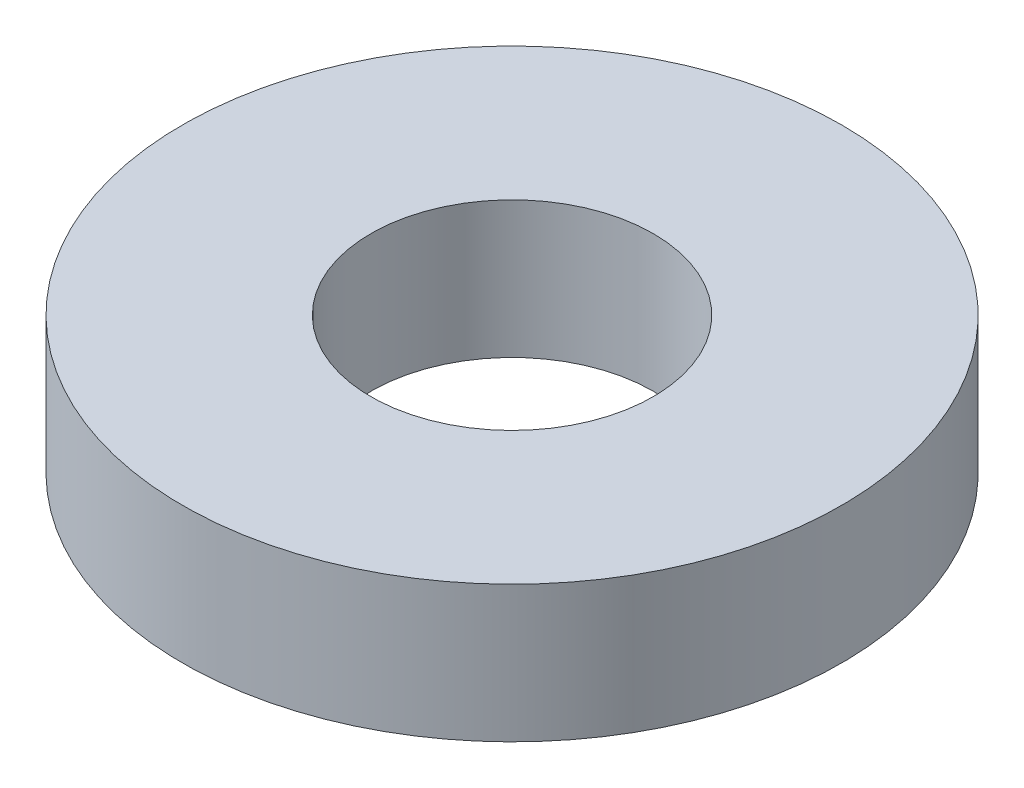
ISO-10303-21;
HEADER;
FILE_DESCRIPTION(('STEP AP214'),'2;1');
FILE_NAME('part.step','',(''),(''),'','','');
FILE_SCHEMA(('AUTOMOTIVE_DESIGN { 1 0 10303 214 1 1 1 1 }'));
ENDSEC;
DATA;
#1=APPLICATION_CONTEXT('core data for automotive mechanical design processes');
#2=APPLICATION_PROTOCOL_DEFINITION('international standard','automotive_design',2000,#1);
#3=PRODUCT_CONTEXT('',#1,'mechanical');
#4=PRODUCT('Part','Part','',(#3));
#5=PRODUCT_RELATED_PRODUCT_CATEGORY('part','',(#4));
#6=PRODUCT_DEFINITION_FORMATION('','',#4);
#7=PRODUCT_DEFINITION_CONTEXT('part definition',#1,'design');
#8=PRODUCT_DEFINITION('design','',#6,#7);
#9=PRODUCT_DEFINITION_SHAPE('','',#8);
#10=(LENGTH_UNIT() NAMED_UNIT(*) SI_UNIT(.MILLI.,.METRE.));
#11=(NAMED_UNIT(*) PLANE_ANGLE_UNIT() SI_UNIT($,.RADIAN.));
#12=(NAMED_UNIT(*) SI_UNIT($,.STERADIAN.) SOLID_ANGLE_UNIT());
#13=UNCERTAINTY_MEASURE_WITH_UNIT(LENGTH_MEASURE(1.E-05),#10,'distance_accuracy_value','');
#14=(GEOMETRIC_REPRESENTATION_CONTEXT(3) GLOBAL_UNCERTAINTY_ASSIGNED_CONTEXT((#13)) GLOBAL_UNIT_ASSIGNED_CONTEXT((#10,
#11,#12)) REPRESENTATION_CONTEXT('',''));
#15=CARTESIAN_POINT('',(0.,0.,0.));
#16=DIRECTION('',(0.,0.,1.));
#17=DIRECTION('',(1.,0.,0.));
#18=AXIS2_PLACEMENT_3D('',#15,#16,#17);
#19=CARTESIAN_POINT('',(0.,29.,0.));
#20=DIRECTION('',(0.,-1.,0.));
#21=DIRECTION('',(0.,0.,-1.));
#22=AXIS2_PLACEMENT_3D('',#19,#20,#21);
#23=CYLINDRICAL_SURFACE('',#22,70.);
#24=CARTESIAN_POINT('',(0.,29.,0.));
#25=DIRECTION('',(0.,1.,0.));
#26=DIRECTION('',(0.,0.,1.));
#27=AXIS2_PLACEMENT_3D('',#24,#25,#26);
#28=CIRCLE('',#27,70.);
#29=CARTESIAN_POINT('',(0.,29.,-70.));
#30=VERTEX_POINT('',#29);
#31=EDGE_CURVE('E10',#30,#30,#28,.T.);
#32=CARTESIAN_POINT('',(0.,0.,0.));
#33=DIRECTION('',(0.,1.,0.));
#34=DIRECTION('',(0.,0.,1.));
#35=AXIS2_PLACEMENT_3D('',#32,#33,#34);
#36=CIRCLE('',#35,70.);
#37=CARTESIAN_POINT('',(0.,0.,-70.));
#38=VERTEX_POINT('',#37);
#39=EDGE_CURVE('E37',#38,#38,#36,.T.);
#40=CARTESIAN_POINT('',(0.,29.,-70.));
#41=CARTESIAN_POINT('',(0.,28.6979166666667,-70.));
#42=CARTESIAN_POINT('',(0.,28.3958333333333,-70.));
#43=CARTESIAN_POINT('',(0.,27.7916666666667,-70.));
#44=CARTESIAN_POINT('',(0.,27.4895833333333,-70.));
#45=CARTESIAN_POINT('',(0.,26.8854166666667,-70.));
#46=CARTESIAN_POINT('',(0.,26.5833333333333,-70.));
#47=CARTESIAN_POINT('',(0.,25.9791666666667,-70.));
#48=CARTESIAN_POINT('',(0.,25.6770833333333,-70.));
#49=CARTESIAN_POINT('',(0.,25.0729166666667,-70.));
#50=CARTESIAN_POINT('',(0.,24.7708333333333,-70.));
#51=CARTESIAN_POINT('',(0.,24.1666666666667,-70.));
#52=CARTESIAN_POINT('',(0.,23.8645833333333,-70.));
#53=CARTESIAN_POINT('',(0.,23.2604166666667,-70.));
#54=CARTESIAN_POINT('',(0.,22.9583333333333,-70.));
#55=CARTESIAN_POINT('',(0.,22.3541666666667,-70.));
#56=CARTESIAN_POINT('',(0.,22.0520833333333,-70.));
#57=CARTESIAN_POINT('',(0.,21.4479166666667,-70.));
#58=CARTESIAN_POINT('',(0.,21.1458333333333,-70.));
#59=CARTESIAN_POINT('',(0.,20.5416666666667,-70.));
#60=CARTESIAN_POINT('',(0.,20.2395833333333,-70.));
#61=CARTESIAN_POINT('',(0.,19.6354166666667,-70.));
#62=CARTESIAN_POINT('',(0.,19.3333333333333,-70.));
#63=CARTESIAN_POINT('',(0.,18.7291666666667,-70.));
#64=CARTESIAN_POINT('',(0.,18.4270833333333,-70.));
#65=CARTESIAN_POINT('',(0.,17.8229166666667,-70.));
#66=CARTESIAN_POINT('',(0.,17.5208333333333,-70.));
#67=CARTESIAN_POINT('',(0.,16.9166666666667,-70.));
#68=CARTESIAN_POINT('',(0.,16.6145833333333,-70.));
#69=CARTESIAN_POINT('',(0.,16.0104166666667,-70.));
#70=CARTESIAN_POINT('',(0.,15.7083333333333,-70.));
#71=CARTESIAN_POINT('',(0.,15.1041666666667,-70.));
#72=CARTESIAN_POINT('',(0.,14.8020833333333,-70.));
#73=CARTESIAN_POINT('',(0.,14.1979166666667,-70.));
#74=CARTESIAN_POINT('',(0.,13.8958333333333,-70.));
#75=CARTESIAN_POINT('',(0.,13.2916666666667,-70.));
#76=CARTESIAN_POINT('',(0.,12.9895833333333,-70.));
#77=CARTESIAN_POINT('',(0.,12.3854166666667,-70.));
#78=CARTESIAN_POINT('',(0.,12.0833333333333,-70.));
#79=CARTESIAN_POINT('',(0.,11.4791666666667,-70.));
#80=CARTESIAN_POINT('',(0.,11.1770833333333,-70.));
#81=CARTESIAN_POINT('',(0.,10.5729166666667,-70.));
#82=CARTESIAN_POINT('',(0.,10.2708333333333,-70.));
#83=CARTESIAN_POINT('',(0.,9.66666666666667,-70.));
#84=CARTESIAN_POINT('',(0.,9.36458333333333,-70.));
#85=CARTESIAN_POINT('',(0.,8.76041666666667,-70.));
#86=CARTESIAN_POINT('',(0.,8.45833333333333,-70.));
#87=CARTESIAN_POINT('',(0.,7.85416666666667,-70.));
#88=CARTESIAN_POINT('',(0.,7.55208333333333,-70.));
#89=CARTESIAN_POINT('',(0.,6.94791666666667,-70.));
#90=CARTESIAN_POINT('',(0.,6.64583333333333,-70.));
#91=CARTESIAN_POINT('',(0.,6.04166666666667,-70.));
#92=CARTESIAN_POINT('',(0.,5.73958333333333,-70.));
#93=CARTESIAN_POINT('',(0.,5.13541666666667,-70.));
#94=CARTESIAN_POINT('',(0.,4.83333333333333,-70.));
#95=CARTESIAN_POINT('',(0.,4.22916666666667,-70.));
#96=CARTESIAN_POINT('',(0.,3.92708333333333,-70.));
#97=CARTESIAN_POINT('',(0.,3.32291666666667,-70.));
#98=CARTESIAN_POINT('',(0.,3.02083333333333,-70.));
#99=CARTESIAN_POINT('',(0.,2.41666666666667,-70.));
#100=CARTESIAN_POINT('',(0.,2.11458333333333,-70.));
#101=CARTESIAN_POINT('',(0.,1.51041666666667,-70.));
#102=CARTESIAN_POINT('',(0.,1.20833333333333,-70.));
#103=CARTESIAN_POINT('',(0.,0.604166666666667,-70.));
#104=CARTESIAN_POINT('',(0.,0.302083333333333,-70.));
#105=CARTESIAN_POINT('',(0.,0.,-70.));
#106=B_SPLINE_CURVE_WITH_KNOTS('',3,(#40,#41,#42,#43,#44,#45,#46,#47,#48,#49,#50,#51,#52,#53,
#54,#55,#56,#57,#58,#59,#60,#61,#62,#63,#64,#65,#66,#67,#68,#69,#70,#71,#72,#73,#74,#75,#76,#77,
#78,#79,#80,#81,#82,#83,#84,#85,#86,#87,#88,#89,#90,#91,#92,#93,#94,#95,#96,#97,#98,#99,#100,
#101,#102,#103,#104,#105),.UNSPECIFIED.,.F.,.F.,(4,2,2,2,2,2,2,2,2,2,2,2,2,2,2,2,2,2,2,2,2,2,2,
2,2,2,2,2,2,2,2,2,4),(0.,0.906250000000001,1.8125,2.71875,3.625,4.53125,5.4375,6.34375,7.25,
8.15625,9.0625,9.96875,10.875,11.78125,12.6875,13.59375,14.5,15.40625,16.3125,17.21875,18.125,
19.03125,19.9375,20.84375,21.75,22.65625,23.5625,24.46875,25.375,26.28125,27.1875,28.09375,29.),.UNSPECIFIED.);
#107=EDGE_CURVE('BSEAM40',#30,#38,#106,.T.);
#108=ORIENTED_EDGE('',*,*,#31,.F.);
#109=ORIENTED_EDGE('',*,*,#39,.T.);
#110=ORIENTED_EDGE('',*,*,#107,.T.);
#111=ORIENTED_EDGE('',*,*,#107,.F.);
#112=EDGE_LOOP('',(#108,#110,#109,#111));
#113=FACE_BOUND('',#112,.T.);
#114=ADVANCED_FACE('F40',(#113),#23,.T.);
#115=CARTESIAN_POINT('',(0.,29.,0.));
#116=DIRECTION('',(0.,1.,0.));
#117=DIRECTION('',(0.,0.,1.));
#118=AXIS2_PLACEMENT_3D('',#115,#116,#117);
#119=PLANE('',#118);
#120=CARTESIAN_POINT('',(0.,29.,0.));
#121=DIRECTION('',(0.,1.,0.));
#122=DIRECTION('',(0.,0.,1.));
#123=AXIS2_PLACEMENT_3D('',#120,#121,#122);
#124=CIRCLE('',#123,30.);
#125=CARTESIAN_POINT('',(0.,29.,-30.));
#126=VERTEX_POINT('',#125);
#127=EDGE_CURVE('E50',#126,#126,#124,.T.);
#128=ORIENTED_EDGE('',*,*,#127,.F.);
#129=EDGE_LOOP('',(#128));
#130=FACE_BOUND('',#129,.T.);
#131=ORIENTED_EDGE('',*,*,#31,.T.);
#132=EDGE_LOOP('',(#131));
#133=FACE_BOUND('',#132,.T.);
#134=ADVANCED_FACE('F59',(#130,#133),#119,.T.);
#135=CARTESIAN_POINT('',(0.,0.,0.));
#136=DIRECTION('',(0.,1.,0.));
#137=DIRECTION('',(0.,0.,1.));
#138=AXIS2_PLACEMENT_3D('',#135,#136,#137);
#139=PLANE('',#138);
#140=CARTESIAN_POINT('',(0.,0.,0.));
#141=DIRECTION('',(0.,1.,0.));
#142=DIRECTION('',(0.,0.,1.));
#143=AXIS2_PLACEMENT_3D('',#140,#141,#142);
#144=CIRCLE('',#143,30.);
#145=CARTESIAN_POINT('',(0.,0.,-30.));
#146=VERTEX_POINT('',#145);
#147=EDGE_CURVE('E47',#146,#146,#144,.T.);
#148=ORIENTED_EDGE('',*,*,#147,.T.);
#149=EDGE_LOOP('',(#148));
#150=FACE_BOUND('',#149,.T.);
#151=ORIENTED_EDGE('',*,*,#39,.F.);
#152=EDGE_LOOP('',(#151));
#153=FACE_BOUND('',#152,.T.);
#154=ADVANCED_FACE('F58',(#150,#153),#139,.F.);
#155=CARTESIAN_POINT('',(0.,29.,0.));
#156=DIRECTION('',(0.,-1.,0.));
#157=DIRECTION('',(0.,0.,-1.));
#158=AXIS2_PLACEMENT_3D('',#155,#156,#157);
#159=CYLINDRICAL_SURFACE('',#158,30.);
#160=CARTESIAN_POINT('',(0.,29.,-30.));
#161=CARTESIAN_POINT('',(0.,28.6979166666667,-30.));
#162=CARTESIAN_POINT('',(0.,28.3958333333333,-30.));
#163=CARTESIAN_POINT('',(0.,27.7916666666667,-30.));
#164=CARTESIAN_POINT('',(0.,27.4895833333333,-30.));
#165=CARTESIAN_POINT('',(0.,26.8854166666667,-30.));
#166=CARTESIAN_POINT('',(0.,26.5833333333333,-30.));
#167=CARTESIAN_POINT('',(0.,25.9791666666667,-30.));
#168=CARTESIAN_POINT('',(0.,25.6770833333333,-30.));
#169=CARTESIAN_POINT('',(0.,25.0729166666667,-30.));
#170=CARTESIAN_POINT('',(0.,24.7708333333333,-30.));
#171=CARTESIAN_POINT('',(0.,24.1666666666667,-30.));
#172=CARTESIAN_POINT('',(0.,23.8645833333333,-30.));
#173=CARTESIAN_POINT('',(0.,23.2604166666667,-30.));
#174=CARTESIAN_POINT('',(0.,22.9583333333333,-30.));
#175=CARTESIAN_POINT('',(0.,22.3541666666667,-30.));
#176=CARTESIAN_POINT('',(0.,22.0520833333333,-30.));
#177=CARTESIAN_POINT('',(0.,21.4479166666667,-30.));
#178=CARTESIAN_POINT('',(0.,21.1458333333333,-30.));
#179=CARTESIAN_POINT('',(0.,20.5416666666667,-30.));
#180=CARTESIAN_POINT('',(0.,20.2395833333333,-30.));
#181=CARTESIAN_POINT('',(0.,19.6354166666667,-30.));
#182=CARTESIAN_POINT('',(0.,19.3333333333333,-30.));
#183=CARTESIAN_POINT('',(0.,18.7291666666667,-30.));
#184=CARTESIAN_POINT('',(0.,18.4270833333333,-30.));
#185=CARTESIAN_POINT('',(0.,17.8229166666667,-30.));
#186=CARTESIAN_POINT('',(0.,17.5208333333333,-30.));
#187=CARTESIAN_POINT('',(0.,16.9166666666667,-30.));
#188=CARTESIAN_POINT('',(0.,16.6145833333333,-30.));
#189=CARTESIAN_POINT('',(0.,16.0104166666667,-30.));
#190=CARTESIAN_POINT('',(0.,15.7083333333333,-30.));
#191=CARTESIAN_POINT('',(0.,15.1041666666667,-30.));
#192=CARTESIAN_POINT('',(0.,14.8020833333333,-30.));
#193=CARTESIAN_POINT('',(0.,14.1979166666667,-30.));
#194=CARTESIAN_POINT('',(0.,13.8958333333333,-30.));
#195=CARTESIAN_POINT('',(0.,13.2916666666667,-30.));
#196=CARTESIAN_POINT('',(0.,12.9895833333333,-30.));
#197=CARTESIAN_POINT('',(0.,12.3854166666667,-30.));
#198=CARTESIAN_POINT('',(0.,12.0833333333333,-30.));
#199=CARTESIAN_POINT('',(0.,11.4791666666667,-30.));
#200=CARTESIAN_POINT('',(0.,11.1770833333333,-30.));
#201=CARTESIAN_POINT('',(0.,10.5729166666667,-30.));
#202=CARTESIAN_POINT('',(0.,10.2708333333333,-30.));
#203=CARTESIAN_POINT('',(0.,9.66666666666667,-30.));
#204=CARTESIAN_POINT('',(0.,9.36458333333333,-30.));
#205=CARTESIAN_POINT('',(0.,8.76041666666667,-30.));
#206=CARTESIAN_POINT('',(0.,8.45833333333333,-30.));
#207=CARTESIAN_POINT('',(0.,7.85416666666667,-30.));
#208=CARTESIAN_POINT('',(0.,7.55208333333333,-30.));
#209=CARTESIAN_POINT('',(0.,6.94791666666667,-30.));
#210=CARTESIAN_POINT('',(0.,6.64583333333333,-30.));
#211=CARTESIAN_POINT('',(0.,6.04166666666667,-30.));
#212=CARTESIAN_POINT('',(0.,5.73958333333333,-30.));
#213=CARTESIAN_POINT('',(0.,5.13541666666667,-30.));
#214=CARTESIAN_POINT('',(0.,4.83333333333333,-30.));
#215=CARTESIAN_POINT('',(0.,4.22916666666667,-30.));
#216=CARTESIAN_POINT('',(0.,3.92708333333333,-30.));
#217=CARTESIAN_POINT('',(0.,3.32291666666667,-30.));
#218=CARTESIAN_POINT('',(0.,3.02083333333333,-30.));
#219=CARTESIAN_POINT('',(0.,2.41666666666667,-30.));
#220=CARTESIAN_POINT('',(0.,2.11458333333333,-30.));
#221=CARTESIAN_POINT('',(0.,1.51041666666667,-30.));
#222=CARTESIAN_POINT('',(0.,1.20833333333333,-30.));
#223=CARTESIAN_POINT('',(0.,0.604166666666667,-30.));
#224=CARTESIAN_POINT('',(0.,0.302083333333333,-30.));
#225=CARTESIAN_POINT('',(0.,0.,-30.));
#226=B_SPLINE_CURVE_WITH_KNOTS('',3,(#160,#161,#162,#163,#164,#165,#166,#167,#168,#169,#170,
#171,#172,#173,#174,#175,#176,#177,#178,#179,#180,#181,#182,#183,#184,#185,#186,#187,#188,#189,
#190,#191,#192,#193,#194,#195,#196,#197,#198,#199,#200,#201,#202,#203,#204,#205,#206,#207,#208,
#209,#210,#211,#212,#213,#214,#215,#216,#217,#218,#219,#220,#221,#222,#223,#224,#225),
.UNSPECIFIED.,.F.,.F.,(4,2,2,2,2,2,2,2,2,2,2,2,2,2,2,2,2,2,2,2,2,2,2,2,2,2,2,2,2,2,2,2,4),(0.,
0.906249999999997,1.8125,2.71875,3.625,4.53125,5.4375,6.34375,7.25,8.15625,9.0625,9.96875,
10.875,11.78125,12.6875,13.59375,14.5,15.40625,16.3125,17.21875,18.125,19.03125,19.9375,
20.84375,21.75,22.65625,23.5625,24.46875,25.375,26.28125,27.1875,28.09375,29.),.UNSPECIFIED.);
#227=EDGE_CURVE('BSEAM54',#126,#146,#226,.T.);
#228=ORIENTED_EDGE('',*,*,#127,.T.);
#229=ORIENTED_EDGE('',*,*,#147,.F.);
#230=ORIENTED_EDGE('',*,*,#227,.T.);
#231=ORIENTED_EDGE('',*,*,#227,.F.);
#232=EDGE_LOOP('',(#228,#230,#229,#231));
#233=FACE_BOUND('',#232,.T.);
#234=ADVANCED_FACE('F54',(#233),#159,.F.);
#235=CLOSED_SHELL('',(#114,#134,#154,#234));
#236=MANIFOLD_SOLID_BREP('B2',#235);
#237=ADVANCED_BREP_SHAPE_REPRESENTATION('',(#18,#236),#14);
#238=SHAPE_DEFINITION_REPRESENTATION(#9,#237);
ENDSEC;
END-ISO-10303-21;
